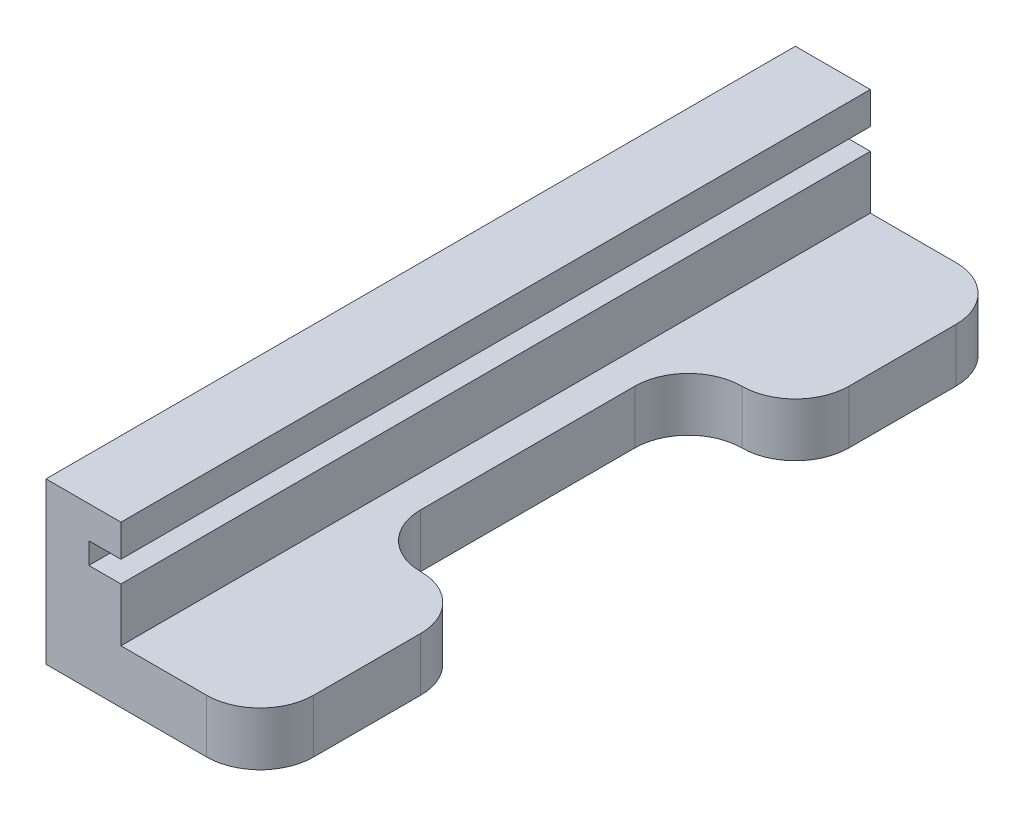
ISO-10303-21;
HEADER;
FILE_DESCRIPTION(('STEP AP214'),'2;1');
FILE_NAME('part.step','',(''),(''),'','','');
FILE_SCHEMA(('AUTOMOTIVE_DESIGN { 1 0 10303 214 1 1 1 1 }'));
ENDSEC;
DATA;
#1=APPLICATION_CONTEXT('core data for automotive mechanical design processes');
#2=APPLICATION_PROTOCOL_DEFINITION('international standard','automotive_design',2000,#1);
#3=PRODUCT_CONTEXT('',#1,'mechanical');
#4=PRODUCT('Part','Part','',(#3));
#5=PRODUCT_RELATED_PRODUCT_CATEGORY('part','',(#4));
#6=PRODUCT_DEFINITION_FORMATION('','',#4);
#7=PRODUCT_DEFINITION_CONTEXT('part definition',#1,'design');
#8=PRODUCT_DEFINITION('design','',#6,#7);
#9=PRODUCT_DEFINITION_SHAPE('','',#8);
#10=(LENGTH_UNIT() NAMED_UNIT(*) SI_UNIT(.MILLI.,.METRE.));
#11=(NAMED_UNIT(*) PLANE_ANGLE_UNIT() SI_UNIT($,.RADIAN.));
#12=(NAMED_UNIT(*) SI_UNIT($,.STERADIAN.) SOLID_ANGLE_UNIT());
#13=UNCERTAINTY_MEASURE_WITH_UNIT(LENGTH_MEASURE(1.E-05),#10,'distance_accuracy_value','');
#14=(GEOMETRIC_REPRESENTATION_CONTEXT(3) GLOBAL_UNCERTAINTY_ASSIGNED_CONTEXT((#13)) GLOBAL_UNIT_ASSIGNED_CONTEXT((#10,
#11,#12)) REPRESENTATION_CONTEXT('',''));
#15=CARTESIAN_POINT('',(0.,0.,0.));
#16=DIRECTION('',(0.,0.,1.));
#17=DIRECTION('',(1.,0.,0.));
#18=AXIS2_PLACEMENT_3D('',#15,#16,#17);
#19=CARTESIAN_POINT('',(0.,5.,0.));
#20=DIRECTION('',(0.,-1.,0.));
#21=DIRECTION('',(0.,0.,-1.));
#22=AXIS2_PLACEMENT_3D('',#19,#20,#21);
#23=PLANE('',#22);
#24=DIRECTION('',(0.,0.,-1.));
#25=VECTOR('',#24,1.);
#26=CARTESIAN_POINT('',(20.,5.,0.));
#27=LINE('',#26,#25);
#28=CARTESIAN_POINT('',(20.,5.,-55.));
#29=VERTEX_POINT('',#28);
#30=CARTESIAN_POINT('',(20.,5.,-65.));
#31=VERTEX_POINT('',#30);
#32=EDGE_CURVE('E231',#29,#31,#27,.T.);
#33=ORIENTED_EDGE('',*,*,#32,.T.);
#34=CARTESIAN_POINT('',(15.,5.,-65.));
#35=DIRECTION('',(0.,-1.,0.));
#36=DIRECTION('',(0.,0.,-1.));
#37=AXIS2_PLACEMENT_3D('',#34,#35,#36);
#38=CIRCLE('',#37,5.);
#39=CARTESIAN_POINT('',(15.,5.,-70.));
#40=VERTEX_POINT('',#39);
#41=EDGE_CURVE('E323',#31,#40,#38,.F.);
#42=ORIENTED_EDGE('',*,*,#41,.T.);
#43=DIRECTION('',(-1.,0.,0.));
#44=VECTOR('',#43,1.);
#45=CARTESIAN_POINT('',(0.,5.,-70.));
#46=LINE('',#45,#44);
#47=CARTESIAN_POINT('',(7.,5.,-70.));
#48=VERTEX_POINT('',#47);
#49=EDGE_CURVE('E236',#40,#48,#46,.T.);
#50=ORIENTED_EDGE('',*,*,#49,.T.);
#51=DIRECTION('',(0.,0.,-1.));
#52=VECTOR('',#51,1.);
#53=CARTESIAN_POINT('',(7.,5.,0.));
#54=LINE('',#53,#52);
#55=CARTESIAN_POINT('',(7.,5.,0.));
#56=VERTEX_POINT('',#55);
#57=EDGE_CURVE('E194',#56,#48,#54,.T.);
#58=ORIENTED_EDGE('',*,*,#57,.F.);
#59=DIRECTION('',(1.,0.,0.));
#60=VECTOR('',#59,1.);
#61=CARTESIAN_POINT('',(0.,5.,0.));
#62=LINE('',#61,#60);
#63=CARTESIAN_POINT('',(15.,5.,0.));
#64=VERTEX_POINT('',#63);
#65=EDGE_CURVE('E228',#56,#64,#62,.T.);
#66=ORIENTED_EDGE('',*,*,#65,.T.);
#67=CARTESIAN_POINT('',(15.,5.,-5.));
#68=DIRECTION('',(0.,-1.,0.));
#69=DIRECTION('',(0.,0.,-1.));
#70=AXIS2_PLACEMENT_3D('',#67,#68,#69);
#71=CIRCLE('',#70,5.);
#72=CARTESIAN_POINT('',(20.,5.,-5.));
#73=VERTEX_POINT('',#72);
#74=EDGE_CURVE('E55',#64,#73,#71,.F.);
#75=ORIENTED_EDGE('',*,*,#74,.T.);
#76=CARTESIAN_POINT('',(20.,5.,-15.));
#77=VERTEX_POINT('',#76);
#78=EDGE_CURVE('E233',#73,#77,#27,.T.);
#79=ORIENTED_EDGE('',*,*,#78,.T.);
#80=CARTESIAN_POINT('',(15.,5.,-15.));
#81=DIRECTION('',(0.,-1.,0.));
#82=DIRECTION('',(0.,0.,-1.));
#83=AXIS2_PLACEMENT_3D('',#80,#81,#82);
#84=CIRCLE('',#83,5.);
#85=CARTESIAN_POINT('',(15.,5.,-20.));
#86=VERTEX_POINT('',#85);
#87=EDGE_CURVE('E267',#77,#86,#84,.F.);
#88=ORIENTED_EDGE('',*,*,#87,.T.);
#89=CARTESIAN_POINT('',(15.,5.,-25.));
#90=DIRECTION('',(0.,-1.,0.));
#91=DIRECTION('',(0.,0.,-1.));
#92=AXIS2_PLACEMENT_3D('',#89,#90,#91);
#93=CIRCLE('',#92,5.);
#94=CARTESIAN_POINT('',(10.,5.,-25.));
#95=VERTEX_POINT('',#94);
#96=EDGE_CURVE('E293',#86,#95,#93,.T.);
#97=ORIENTED_EDGE('',*,*,#96,.T.);
#98=DIRECTION('',(0.,0.,-1.));
#99=VECTOR('',#98,1.);
#100=CARTESIAN_POINT('',(10.,5.,0.));
#101=LINE('',#100,#99);
#102=CARTESIAN_POINT('',(10.,5.,-45.));
#103=VERTEX_POINT('',#102);
#104=EDGE_CURVE('E304',#95,#103,#101,.T.);
#105=ORIENTED_EDGE('',*,*,#104,.T.);
#106=CARTESIAN_POINT('',(15.,5.,-45.));
#107=DIRECTION('',(0.,-1.,0.));
#108=DIRECTION('',(0.,0.,-1.));
#109=AXIS2_PLACEMENT_3D('',#106,#107,#108);
#110=CIRCLE('',#109,5.);
#111=CARTESIAN_POINT('',(15.,5.,-50.));
#112=VERTEX_POINT('',#111);
#113=EDGE_CURVE('E287',#103,#112,#110,.T.);
#114=ORIENTED_EDGE('',*,*,#113,.T.);
#115=CARTESIAN_POINT('',(15.,5.,-55.));
#116=DIRECTION('',(0.,-1.,0.));
#117=DIRECTION('',(0.,0.,-1.));
#118=AXIS2_PLACEMENT_3D('',#115,#116,#117);
#119=CIRCLE('',#118,5.);
#120=EDGE_CURVE('E270',#112,#29,#119,.F.);
#121=ORIENTED_EDGE('',*,*,#120,.T.);
#122=EDGE_LOOP('',(#33,#42,#50,#58,#66,#75,#79,#88,#97,#105,#114,#121));
#123=FACE_BOUND('',#122,.T.);
#124=ADVANCED_FACE('F39',(#123),#23,.F.);
#125=CARTESIAN_POINT('',(20.,5.,0.));
#126=DIRECTION('',(-1.,0.,0.));
#127=DIRECTION('',(0.,0.,1.));
#128=AXIS2_PLACEMENT_3D('',#125,#126,#127);
#129=PLANE('',#128);
#130=DIRECTION('',(0.,0.,-1.));
#131=VECTOR('',#130,1.);
#132=CARTESIAN_POINT('',(20.,0.,0.));
#133=LINE('',#132,#131);
#134=CARTESIAN_POINT('',(20.,0.,-55.));
#135=VERTEX_POINT('',#134);
#136=CARTESIAN_POINT('',(20.,0.,-65.));
#137=VERTEX_POINT('',#136);
#138=EDGE_CURVE('E246',#135,#137,#133,.T.);
#139=ORIENTED_EDGE('',*,*,#138,.T.);
#140=DIRECTION('',(0.,-1.,0.));
#141=VECTOR('',#140,1.);
#142=CARTESIAN_POINT('',(20.,5.,-65.));
#143=LINE('',#142,#141);
#144=EDGE_CURVE('E318',#137,#31,#143,.F.);
#145=ORIENTED_EDGE('',*,*,#144,.T.);
#146=ORIENTED_EDGE('',*,*,#32,.F.);
#147=DIRECTION('',(0.,1.,0.));
#148=VECTOR('',#147,1.);
#149=CARTESIAN_POINT('',(20.,0.,-55.));
#150=LINE('',#149,#148);
#151=EDGE_CURVE('E273',#29,#135,#150,.F.);
#152=ORIENTED_EDGE('',*,*,#151,.T.);
#153=EDGE_LOOP('',(#139,#145,#146,#152));
#154=FACE_BOUND('',#153,.T.);
#155=ADVANCED_FACE('F368',(#154),#129,.F.);
#156=ORIENTED_EDGE('',*,*,#78,.F.);
#157=DIRECTION('',(0.,-1.,0.));
#158=VECTOR('',#157,1.);
#159=CARTESIAN_POINT('',(20.,5.,-5.));
#160=LINE('',#159,#158);
#161=CARTESIAN_POINT('',(20.,0.,-5.));
#162=VERTEX_POINT('',#161);
#163=EDGE_CURVE('E48',#73,#162,#160,.T.);
#164=ORIENTED_EDGE('',*,*,#163,.T.);
#165=CARTESIAN_POINT('',(20.,0.,-15.));
#166=VERTEX_POINT('',#165);
#167=EDGE_CURVE('E247',#162,#166,#133,.T.);
#168=ORIENTED_EDGE('',*,*,#167,.T.);
#169=DIRECTION('',(0.,1.,0.));
#170=VECTOR('',#169,1.);
#171=CARTESIAN_POINT('',(20.,5.,-15.));
#172=LINE('',#171,#170);
#173=EDGE_CURVE('E283',#166,#77,#172,.T.);
#174=ORIENTED_EDGE('',*,*,#173,.T.);
#175=EDGE_LOOP('',(#156,#164,#168,#174));
#176=FACE_BOUND('',#175,.T.);
#177=ADVANCED_FACE('F330',(#176),#129,.F.);
#178=CARTESIAN_POINT('',(0.,0.,0.));
#179=DIRECTION('',(0.,-1.,0.));
#180=DIRECTION('',(0.,0.,-1.));
#181=AXIS2_PLACEMENT_3D('',#178,#179,#180);
#182=PLANE('',#181);
#183=DIRECTION('',(-1.,0.,0.));
#184=VECTOR('',#183,1.);
#185=CARTESIAN_POINT('',(0.,0.,-70.));
#186=LINE('',#185,#184);
#187=CARTESIAN_POINT('',(15.,0.,-70.));
#188=VERTEX_POINT('',#187);
#189=CARTESIAN_POINT('',(0.,0.,-70.));
#190=VERTEX_POINT('',#189);
#191=EDGE_CURVE('E232',#188,#190,#186,.T.);
#192=ORIENTED_EDGE('',*,*,#191,.F.);
#193=CARTESIAN_POINT('',(15.,0.,-65.));
#194=DIRECTION('',(0.,-1.,0.));
#195=DIRECTION('',(0.,0.,-1.));
#196=AXIS2_PLACEMENT_3D('',#193,#194,#195);
#197=CIRCLE('',#196,5.);
#198=EDGE_CURVE('E315',#188,#137,#197,.T.);
#199=ORIENTED_EDGE('',*,*,#198,.T.);
#200=ORIENTED_EDGE('',*,*,#138,.F.);
#201=CARTESIAN_POINT('',(15.,0.,-55.));
#202=DIRECTION('',(0.,-1.,0.));
#203=DIRECTION('',(0.,0.,-1.));
#204=AXIS2_PLACEMENT_3D('',#201,#202,#203);
#205=CIRCLE('',#204,5.);
#206=CARTESIAN_POINT('',(15.,0.,-50.));
#207=VERTEX_POINT('',#206);
#208=EDGE_CURVE('E280',#135,#207,#205,.T.);
#209=ORIENTED_EDGE('',*,*,#208,.T.);
#210=CARTESIAN_POINT('',(15.,0.,-45.));
#211=DIRECTION('',(0.,-1.,0.));
#212=DIRECTION('',(0.,0.,-1.));
#213=AXIS2_PLACEMENT_3D('',#210,#211,#212);
#214=CIRCLE('',#213,5.);
#215=CARTESIAN_POINT('',(10.,0.,-45.));
#216=VERTEX_POINT('',#215);
#217=EDGE_CURVE('E290',#207,#216,#214,.F.);
#218=ORIENTED_EDGE('',*,*,#217,.T.);
#219=DIRECTION('',(0.,0.,-1.));
#220=VECTOR('',#219,1.);
#221=CARTESIAN_POINT('',(10.,0.,0.));
#222=LINE('',#221,#220);
#223=CARTESIAN_POINT('',(10.,0.,-25.));
#224=VERTEX_POINT('',#223);
#225=EDGE_CURVE('E353',#224,#216,#222,.T.);
#226=ORIENTED_EDGE('',*,*,#225,.F.);
#227=CARTESIAN_POINT('',(15.,0.,-25.));
#228=DIRECTION('',(0.,-1.,0.));
#229=DIRECTION('',(0.,0.,-1.));
#230=AXIS2_PLACEMENT_3D('',#227,#228,#229);
#231=CIRCLE('',#230,5.);
#232=CARTESIAN_POINT('',(15.,0.,-20.));
#233=VERTEX_POINT('',#232);
#234=EDGE_CURVE('E296',#224,#233,#231,.F.);
#235=ORIENTED_EDGE('',*,*,#234,.T.);
#236=CARTESIAN_POINT('',(15.,0.,-15.));
#237=DIRECTION('',(0.,-1.,0.));
#238=DIRECTION('',(0.,0.,-1.));
#239=AXIS2_PLACEMENT_3D('',#236,#237,#238);
#240=CIRCLE('',#239,5.);
#241=EDGE_CURVE('E276',#233,#166,#240,.T.);
#242=ORIENTED_EDGE('',*,*,#241,.T.);
#243=ORIENTED_EDGE('',*,*,#167,.F.);
#244=CARTESIAN_POINT('',(15.,0.,-5.));
#245=DIRECTION('',(0.,-1.,0.));
#246=DIRECTION('',(0.,0.,-1.));
#247=AXIS2_PLACEMENT_3D('',#244,#245,#246);
#248=CIRCLE('',#247,5.);
#249=CARTESIAN_POINT('',(15.,0.,0.));
#250=VERTEX_POINT('',#249);
#251=EDGE_CURVE('E312',#162,#250,#248,.T.);
#252=ORIENTED_EDGE('',*,*,#251,.T.);
#253=DIRECTION('',(1.,0.,0.));
#254=VECTOR('',#253,1.);
#255=CARTESIAN_POINT('',(0.,0.,0.));
#256=LINE('',#255,#254);
#257=CARTESIAN_POINT('',(0.,0.,0.));
#258=VERTEX_POINT('',#257);
#259=EDGE_CURVE('E243',#258,#250,#256,.T.);
#260=ORIENTED_EDGE('',*,*,#259,.F.);
#261=DIRECTION('',(0.,0.,1.));
#262=VECTOR('',#261,1.);
#263=CARTESIAN_POINT('',(0.,0.,0.));
#264=LINE('',#263,#262);
#265=EDGE_CURVE('E227',#190,#258,#264,.T.);
#266=ORIENTED_EDGE('',*,*,#265,.F.);
#267=EDGE_LOOP('',(#192,#199,#200,#209,#218,#226,#235,#242,#243,#252,#260,#266));
#268=FACE_BOUND('',#267,.T.);
#269=ADVANCED_FACE('F334',(#268),#182,.T.);
#270=CARTESIAN_POINT('',(0.,5.,0.));
#271=DIRECTION('',(0.,0.,-1.));
#272=DIRECTION('',(-1.,0.,0.));
#273=AXIS2_PLACEMENT_3D('',#270,#271,#272);
#274=PLANE('',#273);
#275=ORIENTED_EDGE('',*,*,#259,.T.);
#276=DIRECTION('',(0.,-1.,0.));
#277=VECTOR('',#276,1.);
#278=CARTESIAN_POINT('',(15.,5.,0.));
#279=LINE('',#278,#277);
#280=EDGE_CURVE('E11',#250,#64,#279,.F.);
#281=ORIENTED_EDGE('',*,*,#280,.T.);
#282=ORIENTED_EDGE('',*,*,#65,.F.);
#283=DIRECTION('',(0.,-1.,0.));
#284=VECTOR('',#283,1.);
#285=CARTESIAN_POINT('',(7.,15.,0.));
#286=LINE('',#285,#284);
#287=CARTESIAN_POINT('',(7.,10.,0.));
#288=VERTEX_POINT('',#287);
#289=EDGE_CURVE('E222',#288,#56,#286,.T.);
#290=ORIENTED_EDGE('',*,*,#289,.F.);
#291=DIRECTION('',(1.,0.,0.));
#292=VECTOR('',#291,1.);
#293=CARTESIAN_POINT('',(4.,10.,0.));
#294=LINE('',#293,#292);
#295=CARTESIAN_POINT('',(4.,10.,0.));
#296=VERTEX_POINT('',#295);
#297=EDGE_CURVE('E202',#296,#288,#294,.T.);
#298=ORIENTED_EDGE('',*,*,#297,.F.);
#299=DIRECTION('',(0.,1.,0.));
#300=VECTOR('',#299,1.);
#301=CARTESIAN_POINT('',(4.,10.,0.));
#302=LINE('',#301,#300);
#303=CARTESIAN_POINT('',(4.,11.9981435230443,0.));
#304=VERTEX_POINT('',#303);
#305=EDGE_CURVE('E414',#296,#304,#302,.T.);
#306=ORIENTED_EDGE('',*,*,#305,.T.);
#307=DIRECTION('',(1.,0.,0.));
#308=VECTOR('',#307,1.);
#309=CARTESIAN_POINT('',(4.,11.9981435230443,0.));
#310=LINE('',#309,#308);
#311=CARTESIAN_POINT('',(7.,11.9981435230443,0.));
#312=VERTEX_POINT('',#311);
#313=EDGE_CURVE('E171',#304,#312,#310,.T.);
#314=ORIENTED_EDGE('',*,*,#313,.T.);
#315=CARTESIAN_POINT('',(7.,15.,0.));
#316=VERTEX_POINT('',#315);
#317=EDGE_CURVE('E223',#316,#312,#286,.T.);
#318=ORIENTED_EDGE('',*,*,#317,.F.);
#319=DIRECTION('',(1.,0.,0.));
#320=VECTOR('',#319,1.);
#321=CARTESIAN_POINT('',(0.,15.,0.));
#322=LINE('',#321,#320);
#323=CARTESIAN_POINT('',(0.,15.,0.));
#324=VERTEX_POINT('',#323);
#325=EDGE_CURVE('E209',#324,#316,#322,.T.);
#326=ORIENTED_EDGE('',*,*,#325,.F.);
#327=DIRECTION('',(0.,-1.,0.));
#328=VECTOR('',#327,1.);
#329=CARTESIAN_POINT('',(0.,5.,0.));
#330=LINE('',#329,#328);
#331=EDGE_CURVE('E255',#324,#258,#330,.T.);
#332=ORIENTED_EDGE('',*,*,#331,.T.);
#333=EDGE_LOOP('',(#275,#281,#282,#290,#298,#306,#314,#318,#326,#332));
#334=FACE_BOUND('',#333,.T.);
#335=ADVANCED_FACE('F381',(#334),#274,.F.);
#336=CARTESIAN_POINT('',(0.,5.,-70.));
#337=DIRECTION('',(0.,0.,1.));
#338=DIRECTION('',(1.,0.,0.));
#339=AXIS2_PLACEMENT_3D('',#336,#337,#338);
#340=PLANE('',#339);
#341=ORIENTED_EDGE('',*,*,#49,.F.);
#342=DIRECTION('',(0.,-1.,0.));
#343=VECTOR('',#342,1.);
#344=CARTESIAN_POINT('',(15.,5.,-70.));
#345=LINE('',#344,#343);
#346=EDGE_CURVE('E299',#40,#188,#345,.T.);
#347=ORIENTED_EDGE('',*,*,#346,.T.);
#348=ORIENTED_EDGE('',*,*,#191,.T.);
#349=DIRECTION('',(0.,-1.,0.));
#350=VECTOR('',#349,1.);
#351=CARTESIAN_POINT('',(0.,5.,-70.));
#352=LINE('',#351,#350);
#353=CARTESIAN_POINT('',(0.,15.,-70.));
#354=VERTEX_POINT('',#353);
#355=EDGE_CURVE('E239',#354,#190,#352,.T.);
#356=ORIENTED_EDGE('',*,*,#355,.F.);
#357=DIRECTION('',(-1.,0.,0.));
#358=VECTOR('',#357,1.);
#359=CARTESIAN_POINT('',(0.,15.,-70.));
#360=LINE('',#359,#358);
#361=CARTESIAN_POINT('',(7.,15.,-70.));
#362=VERTEX_POINT('',#361);
#363=EDGE_CURVE('E215',#362,#354,#360,.T.);
#364=ORIENTED_EDGE('',*,*,#363,.F.);
#365=DIRECTION('',(0.,-1.,0.));
#366=VECTOR('',#365,1.);
#367=CARTESIAN_POINT('',(7.,15.,-70.));
#368=LINE('',#367,#366);
#369=CARTESIAN_POINT('',(7.,11.9981435230443,-70.));
#370=VERTEX_POINT('',#369);
#371=EDGE_CURVE('E192',#362,#370,#368,.T.);
#372=ORIENTED_EDGE('',*,*,#371,.T.);
#373=DIRECTION('',(1.,0.,0.));
#374=VECTOR('',#373,1.);
#375=CARTESIAN_POINT('',(4.,11.9981435230443,-70.));
#376=LINE('',#375,#374);
#377=CARTESIAN_POINT('',(4.,11.9981435230443,-70.));
#378=VERTEX_POINT('',#377);
#379=EDGE_CURVE('E168',#378,#370,#376,.T.);
#380=ORIENTED_EDGE('',*,*,#379,.F.);
#381=DIRECTION('',(0.,1.,0.));
#382=VECTOR('',#381,1.);
#383=CARTESIAN_POINT('',(4.,10.,-70.));
#384=LINE('',#383,#382);
#385=CARTESIAN_POINT('',(4.,10.,-70.));
#386=VERTEX_POINT('',#385);
#387=EDGE_CURVE('E175',#386,#378,#384,.T.);
#388=ORIENTED_EDGE('',*,*,#387,.F.);
#389=DIRECTION('',(1.,0.,0.));
#390=VECTOR('',#389,1.);
#391=CARTESIAN_POINT('',(4.,10.,-70.));
#392=LINE('',#391,#390);
#393=CARTESIAN_POINT('',(7.,10.,-70.));
#394=VERTEX_POINT('',#393);
#395=EDGE_CURVE('E195',#386,#394,#392,.T.);
#396=ORIENTED_EDGE('',*,*,#395,.T.);
#397=EDGE_CURVE('E218',#394,#48,#368,.T.);
#398=ORIENTED_EDGE('',*,*,#397,.T.);
#399=EDGE_LOOP('',(#341,#347,#348,#356,#364,#372,#380,#388,#396,#398));
#400=FACE_BOUND('',#399,.T.);
#401=ADVANCED_FACE('F189',(#400),#340,.F.);
#402=CARTESIAN_POINT('',(7.,15.,0.));
#403=DIRECTION('',(-1.,0.,0.));
#404=DIRECTION('',(0.,0.,1.));
#405=AXIS2_PLACEMENT_3D('',#402,#403,#404);
#406=PLANE('',#405);
#407=DIRECTION('',(0.,0.,-1.));
#408=VECTOR('',#407,1.);
#409=CARTESIAN_POINT('',(7.,11.9981435230443,0.));
#410=LINE('',#409,#408);
#411=EDGE_CURVE('E407',#312,#370,#410,.T.);
#412=ORIENTED_EDGE('',*,*,#411,.T.);
#413=ORIENTED_EDGE('',*,*,#371,.F.);
#414=DIRECTION('',(0.,0.,-1.));
#415=VECTOR('',#414,1.);
#416=CARTESIAN_POINT('',(7.,15.,0.));
#417=LINE('',#416,#415);
#418=EDGE_CURVE('E212',#316,#362,#417,.T.);
#419=ORIENTED_EDGE('',*,*,#418,.F.);
#420=ORIENTED_EDGE('',*,*,#317,.T.);
#421=EDGE_LOOP('',(#412,#413,#419,#420));
#422=FACE_BOUND('',#421,.T.);
#423=ADVANCED_FACE('F383',(#422),#406,.F.);
#424=CARTESIAN_POINT('',(0.,5.,0.));
#425=DIRECTION('',(1.,0.,0.));
#426=DIRECTION('',(0.,0.,-1.));
#427=AXIS2_PLACEMENT_3D('',#424,#425,#426);
#428=PLANE('',#427);
#429=ORIENTED_EDGE('',*,*,#265,.T.);
#430=ORIENTED_EDGE('',*,*,#331,.F.);
#431=DIRECTION('',(0.,0.,1.));
#432=VECTOR('',#431,1.);
#433=CARTESIAN_POINT('',(0.,15.,0.));
#434=LINE('',#433,#432);
#435=EDGE_CURVE('E200',#354,#324,#434,.T.);
#436=ORIENTED_EDGE('',*,*,#435,.F.);
#437=ORIENTED_EDGE('',*,*,#355,.T.);
#438=EDGE_LOOP('',(#429,#430,#436,#437));
#439=FACE_BOUND('',#438,.T.);
#440=ADVANCED_FACE('F387',(#439),#428,.F.);
#441=ORIENTED_EDGE('',*,*,#397,.F.);
#442=DIRECTION('',(0.,0.,-1.));
#443=VECTOR('',#442,1.);
#444=CARTESIAN_POINT('',(7.,10.,0.));
#445=LINE('',#444,#443);
#446=EDGE_CURVE('E176',#288,#394,#445,.T.);
#447=ORIENTED_EDGE('',*,*,#446,.F.);
#448=ORIENTED_EDGE('',*,*,#289,.T.);
#449=ORIENTED_EDGE('',*,*,#57,.T.);
#450=EDGE_LOOP('',(#441,#447,#448,#449));
#451=FACE_BOUND('',#450,.T.);
#452=ADVANCED_FACE('F377',(#451),#406,.F.);
#453=CARTESIAN_POINT('',(0.,15.,0.));
#454=DIRECTION('',(0.,-1.,0.));
#455=DIRECTION('',(0.,0.,-1.));
#456=AXIS2_PLACEMENT_3D('',#453,#454,#455);
#457=PLANE('',#456);
#458=ORIENTED_EDGE('',*,*,#435,.T.);
#459=ORIENTED_EDGE('',*,*,#325,.T.);
#460=ORIENTED_EDGE('',*,*,#418,.T.);
#461=ORIENTED_EDGE('',*,*,#363,.T.);
#462=EDGE_LOOP('',(#458,#459,#460,#461));
#463=FACE_BOUND('',#462,.T.);
#464=ADVANCED_FACE('F441',(#463),#457,.F.);
#465=CARTESIAN_POINT('',(4.,11.9981435230443,0.));
#466=DIRECTION('',(0.,-1.,0.));
#467=DIRECTION('',(0.,0.,-1.));
#468=AXIS2_PLACEMENT_3D('',#465,#466,#467);
#469=PLANE('',#468);
#470=ORIENTED_EDGE('',*,*,#411,.F.);
#471=ORIENTED_EDGE('',*,*,#313,.F.);
#472=DIRECTION('',(0.,0.,-1.));
#473=VECTOR('',#472,1.);
#474=CARTESIAN_POINT('',(4.,11.9981435230443,0.));
#475=LINE('',#474,#473);
#476=EDGE_CURVE('E164',#304,#378,#475,.T.);
#477=ORIENTED_EDGE('',*,*,#476,.T.);
#478=ORIENTED_EDGE('',*,*,#379,.T.);
#479=EDGE_LOOP('',(#470,#471,#477,#478));
#480=FACE_BOUND('',#479,.T.);
#481=ADVANCED_FACE('F166',(#480),#469,.T.);
#482=CARTESIAN_POINT('',(4.,10.,0.));
#483=DIRECTION('',(0.,-1.,0.));
#484=DIRECTION('',(0.,0.,-1.));
#485=AXIS2_PLACEMENT_3D('',#482,#483,#484);
#486=PLANE('',#485);
#487=ORIENTED_EDGE('',*,*,#446,.T.);
#488=ORIENTED_EDGE('',*,*,#395,.F.);
#489=DIRECTION('',(0.,0.,-1.));
#490=VECTOR('',#489,1.);
#491=CARTESIAN_POINT('',(4.,10.,0.));
#492=LINE('',#491,#490);
#493=EDGE_CURVE('E182',#296,#386,#492,.T.);
#494=ORIENTED_EDGE('',*,*,#493,.F.);
#495=ORIENTED_EDGE('',*,*,#297,.T.);
#496=EDGE_LOOP('',(#487,#488,#494,#495));
#497=FACE_BOUND('',#496,.T.);
#498=ADVANCED_FACE('F424',(#497),#486,.F.);
#499=CARTESIAN_POINT('',(4.,0.,0.));
#500=DIRECTION('',(1.,0.,0.));
#501=DIRECTION('',(0.,0.,-1.));
#502=AXIS2_PLACEMENT_3D('',#499,#500,#501);
#503=PLANE('',#502);
#504=ORIENTED_EDGE('',*,*,#476,.F.);
#505=ORIENTED_EDGE('',*,*,#305,.F.);
#506=ORIENTED_EDGE('',*,*,#493,.T.);
#507=ORIENTED_EDGE('',*,*,#387,.T.);
#508=EDGE_LOOP('',(#504,#505,#506,#507));
#509=FACE_BOUND('',#508,.T.);
#510=ADVANCED_FACE('F180',(#509),#503,.T.);
#511=CARTESIAN_POINT('',(10.,0.,0.));
#512=DIRECTION('',(1.,0.,0.));
#513=DIRECTION('',(0.,0.,-1.));
#514=AXIS2_PLACEMENT_3D('',#511,#512,#513);
#515=PLANE('',#514);
#516=ORIENTED_EDGE('',*,*,#225,.T.);
#517=DIRECTION('',(0.,1.,0.));
#518=VECTOR('',#517,1.);
#519=CARTESIAN_POINT('',(10.,5.,-45.));
#520=LINE('',#519,#518);
#521=EDGE_CURVE('E263',#216,#103,#520,.T.);
#522=ORIENTED_EDGE('',*,*,#521,.T.);
#523=ORIENTED_EDGE('',*,*,#104,.F.);
#524=DIRECTION('',(0.,1.,0.));
#525=VECTOR('',#524,1.);
#526=CARTESIAN_POINT('',(10.,0.,-25.));
#527=LINE('',#526,#525);
#528=EDGE_CURVE('E259',#95,#224,#527,.F.);
#529=ORIENTED_EDGE('',*,*,#528,.T.);
#530=EDGE_LOOP('',(#516,#522,#523,#529));
#531=FACE_BOUND('',#530,.T.);
#532=ADVANCED_FACE('F350',(#531),#515,.T.);
#533=CARTESIAN_POINT('',(15.,0.,-55.));
#534=DIRECTION('',(0.,-1.,0.));
#535=DIRECTION('',(0.,0.,-1.));
#536=AXIS2_PLACEMENT_3D('',#533,#534,#535);
#537=CYLINDRICAL_SURFACE('',#536,5.);
#538=DIRECTION('',(0.,1.,0.));
#539=VECTOR('',#538,1.);
#540=CARTESIAN_POINT('',(15.,5.,-50.));
#541=LINE('',#540,#539);
#542=EDGE_CURVE('E300',#207,#112,#541,.T.);
#543=ORIENTED_EDGE('',*,*,#542,.F.);
#544=ORIENTED_EDGE('',*,*,#208,.F.);
#545=ORIENTED_EDGE('',*,*,#151,.F.);
#546=ORIENTED_EDGE('',*,*,#120,.F.);
#547=EDGE_LOOP('',(#543,#544,#545,#546));
#548=FACE_BOUND('',#547,.T.);
#549=ADVANCED_FACE('F392',(#548),#537,.T.);
#550=CARTESIAN_POINT('',(15.,0.,-45.));
#551=DIRECTION('',(0.,-1.,0.));
#552=DIRECTION('',(0.,0.,-1.));
#553=AXIS2_PLACEMENT_3D('',#550,#551,#552);
#554=CYLINDRICAL_SURFACE('',#553,5.);
#555=ORIENTED_EDGE('',*,*,#217,.F.);
#556=ORIENTED_EDGE('',*,*,#542,.T.);
#557=ORIENTED_EDGE('',*,*,#113,.F.);
#558=ORIENTED_EDGE('',*,*,#521,.F.);
#559=EDGE_LOOP('',(#555,#556,#557,#558));
#560=FACE_BOUND('',#559,.T.);
#561=ADVANCED_FACE('F364',(#560),#554,.F.);
#562=CARTESIAN_POINT('',(15.,5.,-15.));
#563=DIRECTION('',(0.,-1.,0.));
#564=DIRECTION('',(0.,0.,-1.));
#565=AXIS2_PLACEMENT_3D('',#562,#563,#564);
#566=CYLINDRICAL_SURFACE('',#565,5.);
#567=ORIENTED_EDGE('',*,*,#173,.F.);
#568=ORIENTED_EDGE('',*,*,#241,.F.);
#569=DIRECTION('',(0.,1.,0.));
#570=VECTOR('',#569,1.);
#571=CARTESIAN_POINT('',(15.,0.,-20.));
#572=LINE('',#571,#570);
#573=EDGE_CURVE('E305',#86,#233,#572,.F.);
#574=ORIENTED_EDGE('',*,*,#573,.F.);
#575=ORIENTED_EDGE('',*,*,#87,.F.);
#576=EDGE_LOOP('',(#567,#568,#574,#575));
#577=FACE_BOUND('',#576,.T.);
#578=ADVANCED_FACE('F341',(#577),#566,.T.);
#579=CARTESIAN_POINT('',(15.,0.,-25.));
#580=DIRECTION('',(0.,-1.,0.));
#581=DIRECTION('',(0.,0.,-1.));
#582=AXIS2_PLACEMENT_3D('',#579,#580,#581);
#583=CYLINDRICAL_SURFACE('',#582,5.);
#584=ORIENTED_EDGE('',*,*,#234,.F.);
#585=ORIENTED_EDGE('',*,*,#528,.F.);
#586=ORIENTED_EDGE('',*,*,#96,.F.);
#587=ORIENTED_EDGE('',*,*,#573,.T.);
#588=EDGE_LOOP('',(#584,#585,#586,#587));
#589=FACE_BOUND('',#588,.T.);
#590=ADVANCED_FACE('F355',(#589),#583,.F.);
#591=CARTESIAN_POINT('',(15.,5.,-65.));
#592=DIRECTION('',(0.,-1.,0.));
#593=DIRECTION('',(0.,0.,-1.));
#594=AXIS2_PLACEMENT_3D('',#591,#592,#593);
#595=CYLINDRICAL_SURFACE('',#594,5.);
#596=ORIENTED_EDGE('',*,*,#41,.F.);
#597=ORIENTED_EDGE('',*,*,#144,.F.);
#598=ORIENTED_EDGE('',*,*,#198,.F.);
#599=ORIENTED_EDGE('',*,*,#346,.F.);
#600=EDGE_LOOP('',(#596,#597,#598,#599));
#601=FACE_BOUND('',#600,.T.);
#602=ADVANCED_FACE('F357',(#601),#595,.T.);
#603=CARTESIAN_POINT('',(15.,5.,-5.));
#604=DIRECTION('',(0.,-1.,0.));
#605=DIRECTION('',(0.,0.,-1.));
#606=AXIS2_PLACEMENT_3D('',#603,#604,#605);
#607=CYLINDRICAL_SURFACE('',#606,5.);
#608=ORIENTED_EDGE('',*,*,#74,.F.);
#609=ORIENTED_EDGE('',*,*,#280,.F.);
#610=ORIENTED_EDGE('',*,*,#251,.F.);
#611=ORIENTED_EDGE('',*,*,#163,.F.);
#612=EDGE_LOOP('',(#608,#609,#610,#611));
#613=FACE_BOUND('',#612,.T.);
#614=ADVANCED_FACE('F41',(#613),#607,.T.);
#615=CLOSED_SHELL('',(#124,#155,#177,#269,#335,#401,#423,#440,#452,#464,#481,#498,#510,#532,
#549,#561,#578,#590,#602,#614));
#616=MANIFOLD_SOLID_BREP('B2',#615);
#617=ADVANCED_BREP_SHAPE_REPRESENTATION('',(#18,#616),#14);
#618=SHAPE_DEFINITION_REPRESENTATION(#9,#617);
ENDSEC;
END-ISO-10303-21;
